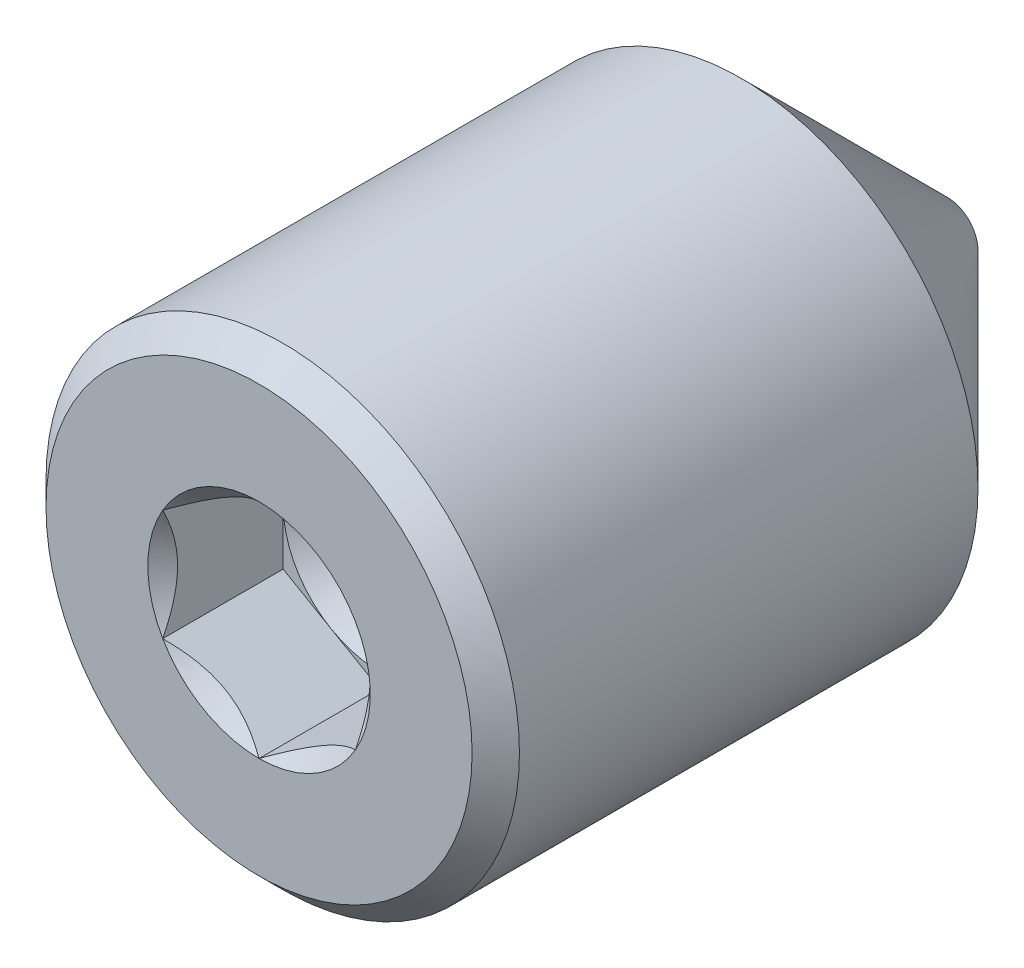
ISO-10303-21;
HEADER;
FILE_DESCRIPTION(('STEP AP214'),'2;1');
FILE_NAME('part.step','',(''),(''),'','','');
FILE_SCHEMA(('AUTOMOTIVE_DESIGN { 1 0 10303 214 1 1 1 1 }'));
ENDSEC;
DATA;
#1=APPLICATION_CONTEXT('core data for automotive mechanical design processes');
#2=APPLICATION_PROTOCOL_DEFINITION('international standard','automotive_design',2000,#1);
#3=PRODUCT_CONTEXT('',#1,'mechanical');
#4=PRODUCT('Part','Part','',(#3));
#5=PRODUCT_RELATED_PRODUCT_CATEGORY('part','',(#4));
#6=PRODUCT_DEFINITION_FORMATION('','',#4);
#7=PRODUCT_DEFINITION_CONTEXT('part definition',#1,'design');
#8=PRODUCT_DEFINITION('design','',#6,#7);
#9=PRODUCT_DEFINITION_SHAPE('','',#8);
#10=(LENGTH_UNIT() NAMED_UNIT(*) SI_UNIT(.MILLI.,.METRE.));
#11=(NAMED_UNIT(*) PLANE_ANGLE_UNIT() SI_UNIT($,.RADIAN.));
#12=(NAMED_UNIT(*) SI_UNIT($,.STERADIAN.) SOLID_ANGLE_UNIT());
#13=UNCERTAINTY_MEASURE_WITH_UNIT(LENGTH_MEASURE(1.E-05),#10,'distance_accuracy_value','');
#14=(GEOMETRIC_REPRESENTATION_CONTEXT(3) GLOBAL_UNCERTAINTY_ASSIGNED_CONTEXT((#13)) GLOBAL_UNIT_ASSIGNED_CONTEXT((#10,
#11,#12)) REPRESENTATION_CONTEXT('',''));
#15=CARTESIAN_POINT('',(0.,0.,0.));
#16=DIRECTION('',(0.,0.,1.));
#17=DIRECTION('',(1.,0.,0.));
#18=AXIS2_PLACEMENT_3D('',#15,#16,#17);
#19=CARTESIAN_POINT('',(0.,0.,1.031875));
#20=DIRECTION('',(0.,0.,1.));
#21=DIRECTION('',(1.,0.,0.));
#22=AXIS2_PLACEMENT_3D('',#19,#20,#21);
#23=PLANE('',#22);
#24=CARTESIAN_POINT('',(0.,0.,1.031875));
#25=DIRECTION('',(0.,0.,1.));
#26=DIRECTION('',(1.,0.,0.));
#27=AXIS2_PLACEMENT_3D('',#24,#25,#26);
#28=CIRCLE('',#27,0.4445);
#29=CARTESIAN_POINT('',(0.4445,0.,1.031875));
#30=VERTEX_POINT('',#29);
#31=CARTESIAN_POINT('',(0.22225,0.384948291982183,1.031875));
#32=VERTEX_POINT('',#31);
#33=EDGE_CURVE('E151',#30,#32,#28,.T.);
#34=ORIENTED_EDGE('',*,*,#33,.F.);
#35=DIRECTION('',(0.,1.,0.));
#36=VECTOR('',#35,1.);
#37=CARTESIAN_POINT('',(0.4445,-0.256632194654789,1.031875));
#38=LINE('',#37,#36);
#39=CARTESIAN_POINT('',(0.4445,0.256632194654789,1.031875));
#40=VERTEX_POINT('',#39);
#41=EDGE_CURVE('E183',#30,#40,#38,.T.);
#42=ORIENTED_EDGE('',*,*,#41,.T.);
#43=DIRECTION('',(-0.866025403784439,0.5,0.));
#44=VECTOR('',#43,1.);
#45=CARTESIAN_POINT('',(0.4445,0.256632194654789,1.031875));
#46=LINE('',#45,#44);
#47=EDGE_CURVE('E176',#40,#32,#46,.T.);
#48=ORIENTED_EDGE('',*,*,#47,.T.);
#49=EDGE_LOOP('',(#34,#42,#48));
#50=FACE_BOUND('',#49,.T.);
#51=ADVANCED_FACE('F47',(#50),#23,.T.);
#52=CARTESIAN_POINT('',(-0.22225,0.384948291982183,1.031875));
#53=VERTEX_POINT('',#52);
#54=EDGE_CURVE('E153',#32,#53,#28,.T.);
#55=ORIENTED_EDGE('',*,*,#54,.F.);
#56=CARTESIAN_POINT('',(0.,0.513264389309577,1.031875));
#57=VERTEX_POINT('',#56);
#58=EDGE_CURVE('E166',#32,#57,#46,.T.);
#59=ORIENTED_EDGE('',*,*,#58,.T.);
#60=DIRECTION('',(-0.866025403784439,-0.5,0.));
#61=VECTOR('',#60,1.);
#62=CARTESIAN_POINT('',(0.,0.513264389309577,1.031875));
#63=LINE('',#62,#61);
#64=EDGE_CURVE('E169',#57,#53,#63,.T.);
#65=ORIENTED_EDGE('',*,*,#64,.T.);
#66=EDGE_LOOP('',(#55,#59,#65));
#67=FACE_BOUND('',#66,.T.);
#68=ADVANCED_FACE('F165',(#67),#23,.T.);
#69=CARTESIAN_POINT('',(-0.4445,0.,1.031875));
#70=VERTEX_POINT('',#69);
#71=EDGE_CURVE('E171',#53,#70,#28,.T.);
#72=ORIENTED_EDGE('',*,*,#71,.F.);
#73=CARTESIAN_POINT('',(-0.4445,0.256632194654789,1.031875));
#74=VERTEX_POINT('',#73);
#75=EDGE_CURVE('E186',#53,#74,#63,.T.);
#76=ORIENTED_EDGE('',*,*,#75,.T.);
#77=DIRECTION('',(0.,-1.,0.));
#78=VECTOR('',#77,1.);
#79=CARTESIAN_POINT('',(-0.4445,0.256632194654789,1.031875));
#80=LINE('',#79,#78);
#81=EDGE_CURVE('E195',#74,#70,#80,.T.);
#82=ORIENTED_EDGE('',*,*,#81,.T.);
#83=EDGE_LOOP('',(#72,#76,#82));
#84=FACE_BOUND('',#83,.T.);
#85=ADVANCED_FACE('F265',(#84),#23,.T.);
#86=CARTESIAN_POINT('',(-0.22225,-0.384948291982183,1.031875));
#87=VERTEX_POINT('',#86);
#88=EDGE_CURVE('E394',#70,#87,#28,.T.);
#89=ORIENTED_EDGE('',*,*,#88,.F.);
#90=CARTESIAN_POINT('',(-0.4445,-0.256632194654789,1.031875));
#91=VERTEX_POINT('',#90);
#92=EDGE_CURVE('E194',#70,#91,#80,.T.);
#93=ORIENTED_EDGE('',*,*,#92,.T.);
#94=DIRECTION('',(0.866025403784439,-0.5,0.));
#95=VECTOR('',#94,1.);
#96=CARTESIAN_POINT('',(-0.4445,-0.256632194654789,1.031875));
#97=LINE('',#96,#95);
#98=EDGE_CURVE('E288',#91,#87,#97,.T.);
#99=ORIENTED_EDGE('',*,*,#98,.T.);
#100=EDGE_LOOP('',(#89,#93,#99));
#101=FACE_BOUND('',#100,.T.);
#102=ADVANCED_FACE('F256',(#101),#23,.T.);
#103=CARTESIAN_POINT('',(0.22225,-0.384948291982183,1.031875));
#104=VERTEX_POINT('',#103);
#105=EDGE_CURVE('E72',#87,#104,#28,.T.);
#106=ORIENTED_EDGE('',*,*,#105,.F.);
#107=CARTESIAN_POINT('',(0.,-0.513264389309577,1.031875));
#108=VERTEX_POINT('',#107);
#109=EDGE_CURVE('E290',#87,#108,#97,.T.);
#110=ORIENTED_EDGE('',*,*,#109,.T.);
#111=DIRECTION('',(0.866025403784439,0.5,0.));
#112=VECTOR('',#111,1.);
#113=CARTESIAN_POINT('',(0.,-0.513264389309577,1.031875));
#114=LINE('',#113,#112);
#115=EDGE_CURVE('E286',#108,#104,#114,.T.);
#116=ORIENTED_EDGE('',*,*,#115,.T.);
#117=EDGE_LOOP('',(#106,#110,#116));
#118=FACE_BOUND('',#117,.T.);
#119=ADVANCED_FACE('F246',(#118),#23,.T.);
#120=CARTESIAN_POINT('',(0.,1.0922,1.5875));
#121=DIRECTION('',(0.,0.,-1.));
#122=DIRECTION('',(-1.,0.,0.));
#123=AXIS2_PLACEMENT_3D('',#120,#121,#122);
#124=PLANE('',#123);
#125=CARTESIAN_POINT('',(0.,0.,1.5875));
#126=DIRECTION('',(0.,0.,1.));
#127=DIRECTION('',(1.,0.,0.));
#128=AXIS2_PLACEMENT_3D('',#125,#126,#127);
#129=CIRCLE('',#128,0.513264389309577);
#130=CARTESIAN_POINT('',(-0.4445,0.256632194654789,1.5875));
#131=VERTEX_POINT('',#130);
#132=CARTESIAN_POINT('',(-0.4445,-0.256632194654789,1.5875));
#133=VERTEX_POINT('',#132);
#134=EDGE_CURVE('E81',#131,#133,#129,.T.);
#135=ORIENTED_EDGE('',*,*,#134,.F.);
#136=CARTESIAN_POINT('',(0.,0.513264389309577,1.5875));
#137=VERTEX_POINT('',#136);
#138=EDGE_CURVE('E371',#137,#131,#129,.T.);
#139=ORIENTED_EDGE('',*,*,#138,.F.);
#140=CARTESIAN_POINT('',(0.4445,0.256632194654789,1.5875));
#141=VERTEX_POINT('',#140);
#142=EDGE_CURVE('E365',#141,#137,#129,.T.);
#143=ORIENTED_EDGE('',*,*,#142,.F.);
#144=CARTESIAN_POINT('',(0.4445,-0.256632194654789,1.5875));
#145=VERTEX_POINT('',#144);
#146=EDGE_CURVE('E160',#145,#141,#129,.T.);
#147=ORIENTED_EDGE('',*,*,#146,.F.);
#148=CARTESIAN_POINT('',(0.,-0.513264389309577,1.5875));
#149=VERTEX_POINT('',#148);
#150=EDGE_CURVE('E363',#149,#145,#129,.T.);
#151=ORIENTED_EDGE('',*,*,#150,.F.);
#152=EDGE_CURVE('E369',#133,#149,#129,.T.);
#153=ORIENTED_EDGE('',*,*,#152,.F.);
#154=EDGE_LOOP('',(#135,#139,#143,#147,#151,#153));
#155=FACE_BOUND('',#154,.T.);
#156=CARTESIAN_POINT('',(0.,0.,1.5875));
#157=DIRECTION('',(0.,0.,-1.));
#158=DIRECTION('',(-1.,0.,0.));
#159=AXIS2_PLACEMENT_3D('',#156,#157,#158);
#160=CIRCLE('',#159,0.982979999999999);
#161=CARTESIAN_POINT('',(-0.982979999999999,0.,1.5875));
#162=VERTEX_POINT('',#161);
#163=EDGE_CURVE('E227',#162,#162,#160,.F.);
#164=ORIENTED_EDGE('',*,*,#163,.T.);
#165=EDGE_LOOP('',(#164));
#166=FACE_BOUND('',#165,.T.);
#167=ADVANCED_FACE('F243',(#155,#166),#124,.F.);
#168=CARTESIAN_POINT('',(0.,0.,-1.5875));
#169=DIRECTION('',(0.,0.,1.));
#170=DIRECTION('',(1.,0.,0.));
#171=AXIS2_PLACEMENT_3D('',#168,#169,#170);
#172=PLANE('',#171);
#173=CARTESIAN_POINT('',(0.,0.,-1.5875));
#174=DIRECTION('',(0.,0.,1.));
#175=DIRECTION('',(1.,0.,0.));
#176=AXIS2_PLACEMENT_3D('',#173,#174,#175);
#177=CIRCLE('',#176,0.141986);
#178=CARTESIAN_POINT('',(0.141986,0.,-1.5875));
#179=VERTEX_POINT('',#178);
#180=EDGE_CURVE('E223',#179,#179,#177,.T.);
#181=ORIENTED_EDGE('',*,*,#180,.F.);
#182=EDGE_LOOP('',(#181));
#183=FACE_BOUND('',#182,.T.);
#184=ADVANCED_FACE('F245',(#183),#172,.F.);
#185=CARTESIAN_POINT('',(0.,0.,-1.5875));
#186=DIRECTION('',(0.,0.,1.));
#187=DIRECTION('',(1.,0.,0.));
#188=AXIS2_PLACEMENT_3D('',#185,#186,#187);
#189=CONICAL_SURFACE('',#188,0.141986,0.78539816339745);
#190=CARTESIAN_POINT('',(0.,0.,-0.637286000000003));
#191=DIRECTION('',(0.,0.,1.));
#192=DIRECTION('',(1.,0.,0.));
#193=AXIS2_PLACEMENT_3D('',#190,#191,#192);
#194=CIRCLE('',#193,1.0922);
#195=CARTESIAN_POINT('',(1.0922,0.,-0.637286000000003));
#196=VERTEX_POINT('',#195);
#197=EDGE_CURVE('E204',#196,#196,#194,.T.);
#198=CARTESIAN_POINT('',(1.0922,0.,-0.637286000000003));
#199=CARTESIAN_POINT('',(1.0823019375,0.,-0.647184062500003));
#200=CARTESIAN_POINT('',(1.072403875,0.,-0.657082125000003));
#201=CARTESIAN_POINT('',(1.05260775,0.,-0.676878250000003));
#202=CARTESIAN_POINT('',(1.0427096875,0.,-0.686776312500003));
#203=CARTESIAN_POINT('',(1.0229135625,0.,-0.706572437500003));
#204=CARTESIAN_POINT('',(1.0130155,0.,-0.716470500000003));
#205=CARTESIAN_POINT('',(0.993219375,0.,-0.736266625000003));
#206=CARTESIAN_POINT('',(0.9833213125,0.,-0.746164687500003));
#207=CARTESIAN_POINT('',(0.9635251875,0.,-0.765960812500003));
#208=CARTESIAN_POINT('',(0.953627125,0.,-0.775858875000003));
#209=CARTESIAN_POINT('',(0.933831,0.,-0.795655000000003));
#210=CARTESIAN_POINT('',(0.9239329375,0.,-0.805553062500003));
#211=CARTESIAN_POINT('',(0.9041368125,0.,-0.825349187500003));
#212=CARTESIAN_POINT('',(0.89423875,0.,-0.835247250000003));
#213=CARTESIAN_POINT('',(0.874442625,0.,-0.855043375000002));
#214=CARTESIAN_POINT('',(0.8645445625,0.,-0.864941437500003));
#215=CARTESIAN_POINT('',(0.8447484375,0.,-0.884737562500002));
#216=CARTESIAN_POINT('',(0.834850375,0.,-0.894635625000002));
#217=CARTESIAN_POINT('',(0.81505425,0.,-0.914431750000002));
#218=CARTESIAN_POINT('',(0.8051561875,0.,-0.924329812500002));
#219=CARTESIAN_POINT('',(0.7853600625,0.,-0.944125937500002));
#220=CARTESIAN_POINT('',(0.775462,0.,-0.954024000000002));
#221=CARTESIAN_POINT('',(0.755665875,0.,-0.973820125000002));
#222=CARTESIAN_POINT('',(0.7457678125,0.,-0.983718187500002));
#223=CARTESIAN_POINT('',(0.7259716875,0.,-1.0035143125));
#224=CARTESIAN_POINT('',(0.716073625,0.,-1.013412375));
#225=CARTESIAN_POINT('',(0.6962775,0.,-1.0332085));
#226=CARTESIAN_POINT('',(0.6863794375,0.,-1.0431065625));
#227=CARTESIAN_POINT('',(0.6665833125,0.,-1.0629026875));
#228=CARTESIAN_POINT('',(0.65668525,0.,-1.07280075));
#229=CARTESIAN_POINT('',(0.636889125,0.,-1.092596875));
#230=CARTESIAN_POINT('',(0.6269910625,0.,-1.1024949375));
#231=CARTESIAN_POINT('',(0.6071949375,0.,-1.1222910625));
#232=CARTESIAN_POINT('',(0.597296875,0.,-1.132189125));
#233=CARTESIAN_POINT('',(0.57750075,0.,-1.15198525));
#234=CARTESIAN_POINT('',(0.5676026875,0.,-1.1618833125));
#235=CARTESIAN_POINT('',(0.5478065625,0.,-1.1816794375));
#236=CARTESIAN_POINT('',(0.5379085,0.,-1.1915775));
#237=CARTESIAN_POINT('',(0.518112375,0.,-1.211373625));
#238=CARTESIAN_POINT('',(0.5082143125,0.,-1.2212716875));
#239=CARTESIAN_POINT('',(0.4884181875,0.,-1.2410678125));
#240=CARTESIAN_POINT('',(0.478520125,0.,-1.250965875));
#241=CARTESIAN_POINT('',(0.458724,0.,-1.270762));
#242=CARTESIAN_POINT('',(0.4488259375,0.,-1.2806600625));
#243=CARTESIAN_POINT('',(0.4290298125,0.,-1.3004561875));
#244=CARTESIAN_POINT('',(0.41913175,0.,-1.31035425));
#245=CARTESIAN_POINT('',(0.399335625,0.,-1.330150375));
#246=CARTESIAN_POINT('',(0.3894375625,0.,-1.3400484375));
#247=CARTESIAN_POINT('',(0.3696414375,0.,-1.3598445625));
#248=CARTESIAN_POINT('',(0.359743375,0.,-1.369742625));
#249=CARTESIAN_POINT('',(0.33994725,0.,-1.38953875));
#250=CARTESIAN_POINT('',(0.3300491875,0.,-1.3994368125));
#251=CARTESIAN_POINT('',(0.3102530625,0.,-1.4192329375));
#252=CARTESIAN_POINT('',(0.300355,0.,-1.429131));
#253=CARTESIAN_POINT('',(0.280558875,0.,-1.448927125));
#254=CARTESIAN_POINT('',(0.2706608125,0.,-1.4588251875));
#255=CARTESIAN_POINT('',(0.2508646875,0.,-1.4786213125));
#256=CARTESIAN_POINT('',(0.240966625,0.,-1.488519375));
#257=CARTESIAN_POINT('',(0.2211705,0.,-1.5083155));
#258=CARTESIAN_POINT('',(0.2112724375,0.,-1.5182135625));
#259=CARTESIAN_POINT('',(0.1914763125,0.,-1.5380096875));
#260=CARTESIAN_POINT('',(0.18157825,0.,-1.54790775));
#261=CARTESIAN_POINT('',(0.161782125,0.,-1.567703875));
#262=CARTESIAN_POINT('',(0.1518840625,0.,-1.5776019375));
#263=CARTESIAN_POINT('',(0.141986,0.,-1.5875));
#264=B_SPLINE_CURVE_WITH_KNOTS('',3,(#198,#199,#200,#201,#202,#203,#204,#205,#206,#207,#208,
#209,#210,#211,#212,#213,#214,#215,#216,#217,#218,#219,#220,#221,#222,#223,#224,#225,#226,#227,
#228,#229,#230,#231,#232,#233,#234,#235,#236,#237,#238,#239,#240,#241,#242,#243,#244,#245,#246,
#247,#248,#249,#250,#251,#252,#253,#254,#255,#256,#257,#258,#259,#260,#261,#262,#263),
.UNSPECIFIED.,.F.,.F.,(4,2,2,2,2,2,2,2,2,2,2,2,2,2,2,2,2,2,2,2,2,2,2,2,2,2,2,2,2,2,2,2,4),(0.,
0.0419939226861495,0.083987845372299,0.125981768058449,0.167975690744598,0.209969613430748,
0.251963536116897,0.293957458803047,0.335951381489196,0.377945304175346,0.419939226861495,
0.461933149547645,0.503927072233794,0.545920994919944,0.587914917606094,0.629908840292243,
0.671902762978393,0.713896685664542,0.755890608350692,0.797884531036841,0.839878453722991,
0.88187237640914,0.92386629909529,0.96586022178144,1.00785414446759,1.04984806715374,
1.09184198983989,1.13383591252604,1.17582983521219,1.21782375789834,1.25981768058449,
1.30181160327064,1.34380552595679),.UNSPECIFIED.);
#265=EDGE_CURVE('BSEAM252',#196,#179,#264,.T.);
#266=ORIENTED_EDGE('',*,*,#197,.F.);
#267=ORIENTED_EDGE('',*,*,#180,.T.);
#268=ORIENTED_EDGE('',*,*,#265,.T.);
#269=ORIENTED_EDGE('',*,*,#265,.F.);
#270=EDGE_LOOP('',(#266,#268,#267,#269));
#271=FACE_BOUND('',#270,.T.);
#272=ADVANCED_FACE('F252',(#271),#189,.T.);
#273=CARTESIAN_POINT('',(0.,0.,1.5875));
#274=DIRECTION('',(0.,0.,1.));
#275=DIRECTION('',(1.,0.,0.));
#276=AXIS2_PLACEMENT_3D('',#273,#274,#275);
#277=CYLINDRICAL_SURFACE('',#276,1.0922);
#278=CARTESIAN_POINT('',(0.,0.,1.47828));
#279=DIRECTION('',(0.,0.,-1.));
#280=DIRECTION('',(-1.,0.,0.));
#281=AXIS2_PLACEMENT_3D('',#278,#279,#280);
#282=CIRCLE('',#281,1.0922);
#283=CARTESIAN_POINT('',(-1.0922,0.,1.47828));
#284=VERTEX_POINT('',#283);
#285=EDGE_CURVE('E62',#284,#284,#282,.T.);
#286=ORIENTED_EDGE('',*,*,#285,.T.);
#287=EDGE_LOOP('',(#286));
#288=FACE_BOUND('',#287,.T.);
#289=ORIENTED_EDGE('',*,*,#197,.T.);
#290=EDGE_LOOP('',(#289));
#291=FACE_BOUND('',#290,.T.);
#292=ADVANCED_FACE('F235',(#288,#291),#277,.T.);
#293=CARTESIAN_POINT('',(0.,0.,1.5875));
#294=DIRECTION('',(0.,0.,-1.));
#295=DIRECTION('',(-1.,0.,0.));
#296=AXIS2_PLACEMENT_3D('',#293,#294,#295);
#297=CONICAL_SURFACE('',#296,0.982979999999999,0.785398163397449);
#298=ORIENTED_EDGE('',*,*,#285,.F.);
#299=EDGE_LOOP('',(#298));
#300=FACE_BOUND('',#299,.T.);
#301=ORIENTED_EDGE('',*,*,#163,.F.);
#302=EDGE_LOOP('',(#301));
#303=FACE_BOUND('',#302,.T.);
#304=ADVANCED_FACE('F49',(#300,#303),#297,.T.);
#305=CARTESIAN_POINT('',(0.,0.,1.5875));
#306=DIRECTION('',(0.,0.,1.));
#307=DIRECTION('',(1.,0.,0.));
#308=AXIS2_PLACEMENT_3D('',#305,#306,#307);
#309=CONICAL_SURFACE('',#308,0.513264389309577,0.78539816339745);
#310=ORIENTED_EDGE('',*,*,#150,.T.);
#311=CARTESIAN_POINT('',(-0.0002,-0.513379859363415,1.58761550901134));
#312=CARTESIAN_POINT('',(0.0150904282118539,-0.504551926519277,1.57879110057877));
#313=CARTESIAN_POINT('',(0.0306356020737622,-0.495576916205504,1.57048369800426));
#314=CARTESIAN_POINT('',(0.062334522171274,-0.477275536154186,1.55527217648255));
#315=CARTESIAN_POINT('',(0.0784912919900499,-0.46794742075008,1.54837653497958));
#316=CARTESIAN_POINT('',(0.111072821191352,-0.449136466095099,1.53656532909836));
#317=CARTESIAN_POINT('',(0.127489226842223,-0.439658449873443,1.53162000653154));
#318=CARTESIAN_POINT('',(0.160675819647773,-0.420498161583672,1.52399425328559));
#319=CARTESIAN_POINT('',(0.177445009476572,-0.410816465321923,1.52130813855292));
#320=CARTESIAN_POINT('',(0.218398789762252,-0.387171789249653,1.51790059470567));
#321=CARTESIAN_POINT('',(0.242679011495559,-0.373153596695944,1.51851597726105));
#322=CARTESIAN_POINT('',(0.290730642294787,-0.345410974719009,1.52486355231913));
#323=CARTESIAN_POINT('',(0.314501236586314,-0.331687015705999,1.53060339160416));
#324=CARTESIAN_POINT('',(0.35625956641124,-0.307577832740669,1.54444991575862));
#325=CARTESIAN_POINT('',(0.374438773811146,-0.297082062454679,1.55183610594815));
#326=CARTESIAN_POINT('',(0.410084463318693,-0.276502014022047,1.56847634221814));
#327=CARTESIAN_POINT('',(0.427553046543219,-0.266416522795005,1.57772431448012));
#328=CARTESIAN_POINT('',(0.4447,-0.256516724600951,1.58761550901134));
#329=B_SPLINE_CURVE_WITH_KNOTS('',3,(#311,#312,#313,#314,#315,#316,#317,#318,#319,#320,#321,
#322,#323,#324,#325,#326,#327,#328),.UNSPECIFIED.,.F.,.F.,(4,2,2,2,2,2,2,2,4),(0.,
0.0592545741399769,0.118855153084928,0.177507465081246,0.236011765586855,0.319609015700824,
0.403331219627383,0.469995632162209,0.536445986043464),.UNSPECIFIED.);
#330=EDGE_CURVE('E11',#149,#145,#329,.T.);
#331=ORIENTED_EDGE('',*,*,#330,.F.);
#332=EDGE_LOOP('',(#310,#331));
#333=FACE_BOUND('',#332,.T.);
#334=ADVANCED_FACE('F240',(#333),#309,.F.);
#335=ORIENTED_EDGE('',*,*,#146,.T.);
#336=CARTESIAN_POINT('',(0.4445,-0.511829342433522,1.75213643365491));
#337=CARTESIAN_POINT('',(0.4445,-0.486891084889183,1.73335043903489));
#338=CARTESIAN_POINT('',(0.4445,-0.461691007430873,1.71487650452443));
#339=CARTESIAN_POINT('',(0.4445,-0.410329660721343,1.67888215067854));
#340=CARTESIAN_POINT('',(0.4445,-0.384162428854917,1.66137028941977));
#341=CARTESIAN_POINT('',(0.4445,-0.329287980819697,1.62698306467267));
#342=CARTESIAN_POINT('',(0.4445,-0.300521037965712,1.61020108521017));
#343=CARTESIAN_POINT('',(0.4445,-0.241568559840238,1.57951080681276));
#344=CARTESIAN_POINT('',(0.4445,-0.211388245708777,1.56559281970172));
#345=CARTESIAN_POINT('',(0.4445,-0.151771739698241,1.54319085629548));
#346=CARTESIAN_POINT('',(0.4445,-0.122473115330602,1.53435817273981));
#347=CARTESIAN_POINT('',(0.4445,-0.0632241889330757,1.52230015674214));
#348=CARTESIAN_POINT('',(0.4445,-0.0332958391310471,1.51897451118934));
#349=CARTESIAN_POINT('',(0.4445,0.0255238480886845,1.51853005778441));
#350=CARTESIAN_POINT('',(0.4445,0.0544135352957961,1.52119107502173));
#351=CARTESIAN_POINT('',(0.4445,0.111708480695749,1.53166779172838));
#352=CARTESIAN_POINT('',(0.4445,0.14009591628793,1.53957455636983));
#353=CARTESIAN_POINT('',(0.4445,0.198086494530433,1.5600441544018));
#354=CARTESIAN_POINT('',(0.4445,0.227553507232478,1.57297446691827));
#355=CARTESIAN_POINT('',(0.4445,0.285120497610206,1.60173046740548));
#356=CARTESIAN_POINT('',(0.4445,0.313215089215117,1.6175665579926));
#357=CARTESIAN_POINT('',(0.4445,0.366904764676342,1.65022724091409));
#358=CARTESIAN_POINT('',(0.4445,0.392554679985773,1.66696360640843));
#359=CARTESIAN_POINT('',(0.4445,0.442864748703385,1.70144464599535));
#360=CARTESIAN_POINT('',(0.4445,0.467531279975358,1.71917995695485));
#361=CARTESIAN_POINT('',(0.4445,0.491928973864434,1.73723965692793));
#362=B_SPLINE_CURVE_WITH_KNOTS('',3,(#336,#337,#338,#339,#340,#341,#342,#343,#344,#345,#346,
#347,#348,#349,#350,#351,#352,#353,#354,#355,#356,#357,#358,#359,#360,#361),.UNSPECIFIED.,.F.,
.F.,(4,2,2,2,2,2,2,2,2,2,2,2,4),(0.,0.0936965174450126,0.188123619017623,0.287940507610602,
0.387413978831585,0.478834218818951,0.568570106804051,0.655059880285827,0.743091820256316,
0.839389678312889,0.936039255964515,1.02788603853754,1.11898185125655),.UNSPECIFIED.);
#363=EDGE_CURVE('E320',#145,#141,#362,.T.);
#364=ORIENTED_EDGE('',*,*,#363,.F.);
#365=EDGE_LOOP('',(#335,#364));
#366=FACE_BOUND('',#365,.T.);
#367=ADVANCED_FACE('F412',(#366),#309,.F.);
#368=ORIENTED_EDGE('',*,*,#142,.T.);
#369=CARTESIAN_POINT('',(0.4447,0.256516724600951,1.58761550901134));
#370=CARTESIAN_POINT('',(0.429409571788146,0.265344657445089,1.57879110057877));
#371=CARTESIAN_POINT('',(0.413864397926238,0.274319667758862,1.57048369800426));
#372=CARTESIAN_POINT('',(0.382165477828726,0.29262104781018,1.55527217648255));
#373=CARTESIAN_POINT('',(0.36600870800995,0.301949163214285,1.54837653497958));
#374=CARTESIAN_POINT('',(0.333427178808648,0.320760117869267,1.53656532909836));
#375=CARTESIAN_POINT('',(0.317010773157777,0.330238134090923,1.53162000653154));
#376=CARTESIAN_POINT('',(0.283824180352226,0.349398422380694,1.52399425328559));
#377=CARTESIAN_POINT('',(0.267054990523428,0.359080118642443,1.52130813855292));
#378=CARTESIAN_POINT('',(0.226101210237748,0.382724794714713,1.51790059470567));
#379=CARTESIAN_POINT('',(0.201820988504441,0.396742987268422,1.51851597726105));
#380=CARTESIAN_POINT('',(0.153769357705213,0.424485609245357,1.52486355231913));
#381=CARTESIAN_POINT('',(0.129998763413685,0.438209568258368,1.53060339160416));
#382=CARTESIAN_POINT('',(0.0882404335887596,0.462318751223698,1.54444991575862));
#383=CARTESIAN_POINT('',(0.0700612261888539,0.472814521509687,1.55183610594815));
#384=CARTESIAN_POINT('',(0.0344155366813068,0.493394569942319,1.56847634221814));
#385=CARTESIAN_POINT('',(0.0169469534567807,0.503480061169361,1.57772431448012));
#386=CARTESIAN_POINT('',(-0.000200000000000038,0.513379859363415,1.58761550901134));
#387=B_SPLINE_CURVE_WITH_KNOTS('',3,(#369,#370,#371,#372,#373,#374,#375,#376,#377,#378,#379,
#380,#381,#382,#383,#384,#385,#386),.UNSPECIFIED.,.F.,.F.,(4,2,2,2,2,2,2,2,4),(0.,
0.0592545741399767,0.118855153084928,0.177507465081246,0.236011765586855,0.319609015700824,
0.403331219627383,0.46999563216221,0.536445986043464),.UNSPECIFIED.);
#388=EDGE_CURVE('E329',#141,#137,#387,.T.);
#389=ORIENTED_EDGE('',*,*,#388,.F.);
#390=EDGE_LOOP('',(#368,#389));
#391=FACE_BOUND('',#390,.T.);
#392=ADVANCED_FACE('F410',(#391),#309,.F.);
#393=ORIENTED_EDGE('',*,*,#138,.T.);
#394=CARTESIAN_POINT('',(0.000200000000000019,0.513379859363415,1.58761550901134));
#395=CARTESIAN_POINT('',(-0.0150904282118539,0.504551926519277,1.57879110057877));
#396=CARTESIAN_POINT('',(-0.0306356020737621,0.495576916205504,1.57048369800426));
#397=CARTESIAN_POINT('',(-0.0623345221712739,0.477275536154186,1.55527217648255));
#398=CARTESIAN_POINT('',(-0.0784912919900498,0.46794742075008,1.54837653497958));
#399=CARTESIAN_POINT('',(-0.111072821191352,0.449136466095099,1.53656532909836));
#400=CARTESIAN_POINT('',(-0.127489226842222,0.439658449873443,1.53162000653154));
#401=CARTESIAN_POINT('',(-0.160675819647773,0.420498161583672,1.52399425328559));
#402=CARTESIAN_POINT('',(-0.177445009476572,0.410816465321923,1.52130813855292));
#403=CARTESIAN_POINT('',(-0.218398789762252,0.387171789249653,1.51790059470567));
#404=CARTESIAN_POINT('',(-0.242679011495559,0.373153596695944,1.51851597726105));
#405=CARTESIAN_POINT('',(-0.290730642294787,0.345410974719009,1.52486355231913));
#406=CARTESIAN_POINT('',(-0.314501236586314,0.331687015705999,1.53060339160416));
#407=CARTESIAN_POINT('',(-0.35625956641124,0.307577832740669,1.54444991575862));
#408=CARTESIAN_POINT('',(-0.374438773811146,0.297082062454679,1.55183610594815));
#409=CARTESIAN_POINT('',(-0.410084463318693,0.276502014022047,1.56847634221814));
#410=CARTESIAN_POINT('',(-0.427553046543219,0.266416522795005,1.57772431448012));
#411=CARTESIAN_POINT('',(-0.4447,0.256516724600951,1.58761550901134));
#412=B_SPLINE_CURVE_WITH_KNOTS('',3,(#394,#395,#396,#397,#398,#399,#400,#401,#402,#403,#404,
#405,#406,#407,#408,#409,#410,#411),.UNSPECIFIED.,.F.,.F.,(4,2,2,2,2,2,2,2,4),(0.,
0.0592545741399768,0.118855153084928,0.177507465081246,0.236011765586855,0.319609015700824,
0.403331219627383,0.46999563216221,0.536445986043464),.UNSPECIFIED.);
#413=EDGE_CURVE('E335',#137,#131,#412,.T.);
#414=ORIENTED_EDGE('',*,*,#413,.F.);
#415=EDGE_LOOP('',(#393,#414));
#416=FACE_BOUND('',#415,.T.);
#417=ADVANCED_FACE('F409',(#416),#309,.F.);
#418=ORIENTED_EDGE('',*,*,#134,.T.);
#419=CARTESIAN_POINT('',(-0.4445,-0.511829342433522,1.75213643365491));
#420=CARTESIAN_POINT('',(-0.4445,-0.486891084889183,1.73335043903489));
#421=CARTESIAN_POINT('',(-0.4445,-0.461691007430874,1.71487650452443));
#422=CARTESIAN_POINT('',(-0.4445,-0.410329660721343,1.67888215067854));
#423=CARTESIAN_POINT('',(-0.4445,-0.384162428854917,1.66137028941977));
#424=CARTESIAN_POINT('',(-0.4445,-0.329287980819697,1.62698306467267));
#425=CARTESIAN_POINT('',(-0.4445,-0.300521037965712,1.61020108521017));
#426=CARTESIAN_POINT('',(-0.4445,-0.241568559840238,1.57951080681276));
#427=CARTESIAN_POINT('',(-0.4445,-0.211388245708777,1.56559281970172));
#428=CARTESIAN_POINT('',(-0.4445,-0.151771739698241,1.54319085629548));
#429=CARTESIAN_POINT('',(-0.4445,-0.122473115330602,1.53435817273981));
#430=CARTESIAN_POINT('',(-0.4445,-0.0632241889330757,1.52230015674214));
#431=CARTESIAN_POINT('',(-0.4445,-0.0332958391310472,1.51897451118934));
#432=CARTESIAN_POINT('',(-0.4445,0.0255238480886844,1.51853005778441));
#433=CARTESIAN_POINT('',(-0.4445,0.0544135352957959,1.52119107502173));
#434=CARTESIAN_POINT('',(-0.4445,0.111708480695749,1.53166779172838));
#435=CARTESIAN_POINT('',(-0.4445,0.140095916287929,1.53957455636983));
#436=CARTESIAN_POINT('',(-0.4445,0.198086494530433,1.5600441544018));
#437=CARTESIAN_POINT('',(-0.4445,0.227553507232478,1.57297446691827));
#438=CARTESIAN_POINT('',(-0.4445,0.285120497610205,1.60173046740548));
#439=CARTESIAN_POINT('',(-0.4445,0.313215089215117,1.6175665579926));
#440=CARTESIAN_POINT('',(-0.4445,0.366904764676342,1.65022724091409));
#441=CARTESIAN_POINT('',(-0.4445,0.392554679985773,1.66696360640843));
#442=CARTESIAN_POINT('',(-0.4445,0.442864748703384,1.70144464599535));
#443=CARTESIAN_POINT('',(-0.4445,0.467531279975358,1.71917995695485));
#444=CARTESIAN_POINT('',(-0.4445,0.491928973864433,1.73723965692793));
#445=B_SPLINE_CURVE_WITH_KNOTS('',3,(#419,#420,#421,#422,#423,#424,#425,#426,#427,#428,#429,
#430,#431,#432,#433,#434,#435,#436,#437,#438,#439,#440,#441,#442,#443,#444),.UNSPECIFIED.,.F.,
.F.,(4,2,2,2,2,2,2,2,2,2,2,2,4),(0.,0.0936965174450127,0.188123619017623,0.287940507610602,
0.387413978831585,0.478834218818951,0.568570106804051,0.655059880285827,0.743091820256315,
0.839389678312888,0.936039255964514,1.02788603853754,1.11898185125655),.UNSPECIFIED.);
#446=EDGE_CURVE('E306',#131,#133,#445,.F.);
#447=ORIENTED_EDGE('',*,*,#446,.F.);
#448=EDGE_LOOP('',(#418,#447));
#449=FACE_BOUND('',#448,.T.);
#450=ADVANCED_FACE('F276',(#449),#309,.F.);
#451=ORIENTED_EDGE('',*,*,#152,.T.);
#452=CARTESIAN_POINT('',(-0.4447,-0.256516724600951,1.58761550901134));
#453=CARTESIAN_POINT('',(-0.429409571788146,-0.265344657445089,1.57879110057877));
#454=CARTESIAN_POINT('',(-0.413864397926238,-0.274319667758862,1.57048369800426));
#455=CARTESIAN_POINT('',(-0.382165477828726,-0.29262104781018,1.55527217648255));
#456=CARTESIAN_POINT('',(-0.36600870800995,-0.301949163214286,1.54837653497958));
#457=CARTESIAN_POINT('',(-0.333427178808648,-0.320760117869267,1.53656532909836));
#458=CARTESIAN_POINT('',(-0.317010773157777,-0.330238134090923,1.53162000653154));
#459=CARTESIAN_POINT('',(-0.283824180352227,-0.349398422380694,1.52399425328559));
#460=CARTESIAN_POINT('',(-0.267054990523428,-0.359080118642443,1.52130813855292));
#461=CARTESIAN_POINT('',(-0.226101210237748,-0.382724794714713,1.51790059470567));
#462=CARTESIAN_POINT('',(-0.201820988504441,-0.396742987268422,1.51851597726105));
#463=CARTESIAN_POINT('',(-0.153769357705213,-0.424485609245357,1.52486355231913));
#464=CARTESIAN_POINT('',(-0.129998763413685,-0.438209568258367,1.53060339160416));
#465=CARTESIAN_POINT('',(-0.0882404335887598,-0.462318751223697,1.54444991575862));
#466=CARTESIAN_POINT('',(-0.0700612261888541,-0.472814521509687,1.55183610594815));
#467=CARTESIAN_POINT('',(-0.0344155366813069,-0.493394569942319,1.56847634221814));
#468=CARTESIAN_POINT('',(-0.0169469534567808,-0.503480061169361,1.57772431448012));
#469=CARTESIAN_POINT('',(0.000200000000000003,-0.513379859363415,1.58761550901134));
#470=B_SPLINE_CURVE_WITH_KNOTS('',3,(#452,#453,#454,#455,#456,#457,#458,#459,#460,#461,#462,
#463,#464,#465,#466,#467,#468,#469),.UNSPECIFIED.,.F.,.F.,(4,2,2,2,2,2,2,2,4),(0.,
0.0592545741399769,0.118855153084928,0.177507465081246,0.236011765586855,0.319609015700824,
0.403331219627383,0.46999563216221,0.536445986043464),.UNSPECIFIED.);
#471=EDGE_CURVE('E297',#133,#149,#470,.T.);
#472=ORIENTED_EDGE('',*,*,#471,.F.);
#473=EDGE_LOOP('',(#451,#472));
#474=FACE_BOUND('',#473,.T.);
#475=ADVANCED_FACE('F269',(#474),#309,.F.);
#476=EDGE_CURVE('E155',#104,#30,#28,.T.);
#477=ORIENTED_EDGE('',*,*,#476,.F.);
#478=CARTESIAN_POINT('',(0.4445,-0.256632194654789,1.031875));
#479=VERTEX_POINT('',#478);
#480=EDGE_CURVE('E280',#104,#479,#114,.T.);
#481=ORIENTED_EDGE('',*,*,#480,.T.);
#482=EDGE_CURVE('E181',#479,#30,#38,.T.);
#483=ORIENTED_EDGE('',*,*,#482,.T.);
#484=EDGE_LOOP('',(#477,#481,#483));
#485=FACE_BOUND('',#484,.T.);
#486=ADVANCED_FACE('F259',(#485),#23,.T.);
#487=CARTESIAN_POINT('',(0.,-0.513264389309577,1.031875));
#488=DIRECTION('',(0.5,-0.866025403784439,0.));
#489=DIRECTION('',(0.866025403784439,0.5,0.));
#490=AXIS2_PLACEMENT_3D('',#487,#488,#489);
#491=PLANE('',#490);
#492=DIRECTION('',(0.,0.,1.));
#493=VECTOR('',#492,1.);
#494=CARTESIAN_POINT('',(0.,-0.513264389309577,1.031875));
#495=LINE('',#494,#493);
#496=EDGE_CURVE('E199',#108,#149,#495,.T.);
#497=ORIENTED_EDGE('',*,*,#496,.T.);
#498=ORIENTED_EDGE('',*,*,#330,.T.);
#499=DIRECTION('',(0.,0.,1.));
#500=VECTOR('',#499,1.);
#501=CARTESIAN_POINT('',(0.4445,-0.256632194654789,1.031875));
#502=LINE('',#501,#500);
#503=EDGE_CURVE('E213',#479,#145,#502,.T.);
#504=ORIENTED_EDGE('',*,*,#503,.F.);
#505=ORIENTED_EDGE('',*,*,#480,.F.);
#506=ORIENTED_EDGE('',*,*,#115,.F.);
#507=EDGE_LOOP('',(#497,#498,#504,#505,#506));
#508=FACE_BOUND('',#507,.T.);
#509=ADVANCED_FACE('F268',(#508),#491,.F.);
#510=CARTESIAN_POINT('',(0.4445,-0.256632194654789,1.031875));
#511=DIRECTION('',(1.,0.,0.));
#512=DIRECTION('',(0.,0.,-1.));
#513=AXIS2_PLACEMENT_3D('',#510,#511,#512);
#514=PLANE('',#513);
#515=ORIENTED_EDGE('',*,*,#503,.T.);
#516=ORIENTED_EDGE('',*,*,#363,.T.);
#517=DIRECTION('',(0.,0.,1.));
#518=VECTOR('',#517,1.);
#519=CARTESIAN_POINT('',(0.4445,0.256632194654789,1.031875));
#520=LINE('',#519,#518);
#521=EDGE_CURVE('E210',#40,#141,#520,.T.);
#522=ORIENTED_EDGE('',*,*,#521,.F.);
#523=ORIENTED_EDGE('',*,*,#41,.F.);
#524=ORIENTED_EDGE('',*,*,#482,.F.);
#525=EDGE_LOOP('',(#515,#516,#522,#523,#524));
#526=FACE_BOUND('',#525,.T.);
#527=ADVANCED_FACE('F274',(#526),#514,.F.);
#528=CARTESIAN_POINT('',(0.4445,0.256632194654789,1.031875));
#529=DIRECTION('',(0.5,0.866025403784439,0.));
#530=DIRECTION('',(-0.866025403784439,0.5,0.));
#531=AXIS2_PLACEMENT_3D('',#528,#529,#530);
#532=PLANE('',#531);
#533=ORIENTED_EDGE('',*,*,#521,.T.);
#534=ORIENTED_EDGE('',*,*,#388,.T.);
#535=DIRECTION('',(0.,0.,1.));
#536=VECTOR('',#535,1.);
#537=CARTESIAN_POINT('',(0.,0.513264389309577,1.031875));
#538=LINE('',#537,#536);
#539=EDGE_CURVE('E179',#57,#137,#538,.T.);
#540=ORIENTED_EDGE('',*,*,#539,.F.);
#541=ORIENTED_EDGE('',*,*,#58,.F.);
#542=ORIENTED_EDGE('',*,*,#47,.F.);
#543=EDGE_LOOP('',(#533,#534,#540,#541,#542));
#544=FACE_BOUND('',#543,.T.);
#545=ADVANCED_FACE('F175',(#544),#532,.F.);
#546=CARTESIAN_POINT('',(0.,0.513264389309577,1.031875));
#547=DIRECTION('',(-0.5,0.866025403784439,0.));
#548=DIRECTION('',(-0.866025403784439,-0.5,0.));
#549=AXIS2_PLACEMENT_3D('',#546,#547,#548);
#550=PLANE('',#549);
#551=ORIENTED_EDGE('',*,*,#539,.T.);
#552=ORIENTED_EDGE('',*,*,#413,.T.);
#553=DIRECTION('',(0.,0.,1.));
#554=VECTOR('',#553,1.);
#555=CARTESIAN_POINT('',(-0.4445,0.256632194654789,1.031875));
#556=LINE('',#555,#554);
#557=EDGE_CURVE('E205',#74,#131,#556,.T.);
#558=ORIENTED_EDGE('',*,*,#557,.F.);
#559=ORIENTED_EDGE('',*,*,#75,.F.);
#560=ORIENTED_EDGE('',*,*,#64,.F.);
#561=EDGE_LOOP('',(#551,#552,#558,#559,#560));
#562=FACE_BOUND('',#561,.T.);
#563=ADVANCED_FACE('F343',(#562),#550,.F.);
#564=CARTESIAN_POINT('',(-0.4445,0.256632194654789,1.031875));
#565=DIRECTION('',(-1.,0.,0.));
#566=DIRECTION('',(0.,-1.,0.));
#567=AXIS2_PLACEMENT_3D('',#564,#565,#566);
#568=PLANE('',#567);
#569=ORIENTED_EDGE('',*,*,#557,.T.);
#570=ORIENTED_EDGE('',*,*,#446,.T.);
#571=DIRECTION('',(0.,0.,1.));
#572=VECTOR('',#571,1.);
#573=CARTESIAN_POINT('',(-0.4445,-0.256632194654789,1.031875));
#574=LINE('',#573,#572);
#575=EDGE_CURVE('E200',#91,#133,#574,.T.);
#576=ORIENTED_EDGE('',*,*,#575,.F.);
#577=ORIENTED_EDGE('',*,*,#92,.F.);
#578=ORIENTED_EDGE('',*,*,#81,.F.);
#579=EDGE_LOOP('',(#569,#570,#576,#577,#578));
#580=FACE_BOUND('',#579,.T.);
#581=ADVANCED_FACE('F346',(#580),#568,.F.);
#582=CARTESIAN_POINT('',(-0.4445,-0.256632194654789,1.031875));
#583=DIRECTION('',(-0.5,-0.866025403784439,0.));
#584=DIRECTION('',(0.866025403784439,-0.5,0.));
#585=AXIS2_PLACEMENT_3D('',#582,#583,#584);
#586=PLANE('',#585);
#587=ORIENTED_EDGE('',*,*,#575,.T.);
#588=ORIENTED_EDGE('',*,*,#471,.T.);
#589=ORIENTED_EDGE('',*,*,#496,.F.);
#590=ORIENTED_EDGE('',*,*,#109,.F.);
#591=ORIENTED_EDGE('',*,*,#98,.F.);
#592=EDGE_LOOP('',(#587,#588,#589,#590,#591));
#593=FACE_BOUND('',#592,.T.);
#594=ADVANCED_FACE('F148',(#593),#586,.F.);
#595=CARTESIAN_POINT('',(0.,0.,1.031875));
#596=DIRECTION('',(0.,0.,1.));
#597=DIRECTION('',(1.,0.,0.));
#598=AXIS2_PLACEMENT_3D('',#595,#596,#597);
#599=CONICAL_SURFACE('',#598,0.4445,0.78539816339745);
#600=CARTESIAN_POINT('',(0.,0.,0.587375000000001));
#601=VERTEX_POINT('',#600);
#602=VERTEX_LOOP('',#601);
#603=FACE_BOUND('',#602,.T.);
#604=ORIENTED_EDGE('',*,*,#33,.T.);
#605=ORIENTED_EDGE('',*,*,#54,.T.);
#606=ORIENTED_EDGE('',*,*,#71,.T.);
#607=ORIENTED_EDGE('',*,*,#88,.T.);
#608=ORIENTED_EDGE('',*,*,#105,.T.);
#609=ORIENTED_EDGE('',*,*,#476,.T.);
#610=EDGE_LOOP('',(#604,#605,#606,#607,#608,#609));
#611=FACE_BOUND('',#610,.T.);
#612=ADVANCED_FACE('F146',(#603,#611),#599,.F.);
#613=CLOSED_SHELL('',(#51,#68,#85,#102,#119,#167,#184,#272,#292,#304,#334,#367,#392,#417,#450,
#475,#486,#509,#527,#545,#563,#581,#594,#612));
#614=MANIFOLD_SOLID_BREP('B2',#613);
#615=ADVANCED_BREP_SHAPE_REPRESENTATION('',(#18,#614),#14);
#616=SHAPE_DEFINITION_REPRESENTATION(#9,#615);
ENDSEC;
END-ISO-10303-21;
